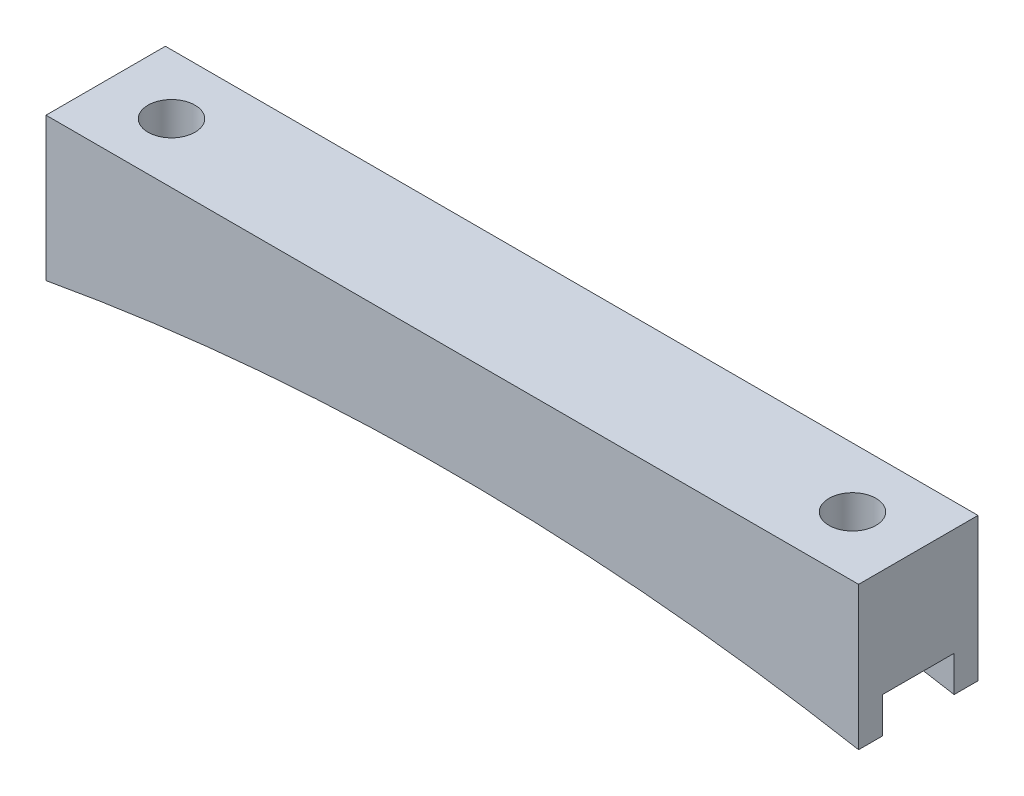
ISO-10303-21;
HEADER;
FILE_DESCRIPTION(('STEP AP214'),'2;1');
FILE_NAME('part.step','',(''),(''),'','','');
FILE_SCHEMA(('AUTOMOTIVE_DESIGN { 1 0 10303 214 1 1 1 1 }'));
ENDSEC;
DATA;
#1=APPLICATION_CONTEXT('core data for automotive mechanical design processes');
#2=APPLICATION_PROTOCOL_DEFINITION('international standard','automotive_design',2000,#1);
#3=PRODUCT_CONTEXT('',#1,'mechanical');
#4=PRODUCT('Part','Part','',(#3));
#5=PRODUCT_RELATED_PRODUCT_CATEGORY('part','',(#4));
#6=PRODUCT_DEFINITION_FORMATION('','',#4);
#7=PRODUCT_DEFINITION_CONTEXT('part definition',#1,'design');
#8=PRODUCT_DEFINITION('design','',#6,#7);
#9=PRODUCT_DEFINITION_SHAPE('','',#8);
#10=(LENGTH_UNIT() NAMED_UNIT(*) SI_UNIT(.MILLI.,.METRE.));
#11=(NAMED_UNIT(*) PLANE_ANGLE_UNIT() SI_UNIT($,.RADIAN.));
#12=(NAMED_UNIT(*) SI_UNIT($,.STERADIAN.) SOLID_ANGLE_UNIT());
#13=UNCERTAINTY_MEASURE_WITH_UNIT(LENGTH_MEASURE(1.E-05),#10,'distance_accuracy_value','');
#14=(GEOMETRIC_REPRESENTATION_CONTEXT(3) GLOBAL_UNCERTAINTY_ASSIGNED_CONTEXT((#13)) GLOBAL_UNIT_ASSIGNED_CONTEXT((#10,
#11,#12)) REPRESENTATION_CONTEXT('',''));
#15=CARTESIAN_POINT('',(0.,0.,0.));
#16=DIRECTION('',(0.,0.,1.));
#17=DIRECTION('',(1.,0.,0.));
#18=AXIS2_PLACEMENT_3D('',#15,#16,#17);
#19=CARTESIAN_POINT('',(43.22,0.,12.7));
#20=DIRECTION('',(-1.,0.,0.));
#21=DIRECTION('',(0.,-1.,0.));
#22=AXIS2_PLACEMENT_3D('',#19,#20,#21);
#23=PLANE('',#22);
#24=DIRECTION('',(0.,0.,-1.));
#25=VECTOR('',#24,1.);
#26=CARTESIAN_POINT('',(43.22,-15.24,12.7));
#27=LINE('',#26,#25);
#28=CARTESIAN_POINT('',(43.22,-15.24,12.7));
#29=VERTEX_POINT('',#28);
#30=CARTESIAN_POINT('',(43.22,-15.24,10.16));
#31=VERTEX_POINT('',#30);
#32=EDGE_CURVE('E156',#29,#31,#27,.T.);
#33=ORIENTED_EDGE('',*,*,#32,.T.);
#34=DIRECTION('',(0.,-1.,0.));
#35=VECTOR('',#34,1.);
#36=CARTESIAN_POINT('',(43.22,-15.24,10.16));
#37=LINE('',#36,#35);
#38=CARTESIAN_POINT('',(43.22,-11.43,10.16));
#39=VERTEX_POINT('',#38);
#40=EDGE_CURVE('E185',#39,#31,#37,.T.);
#41=ORIENTED_EDGE('',*,*,#40,.F.);
#42=DIRECTION('',(0.,0.,1.));
#43=VECTOR('',#42,1.);
#44=CARTESIAN_POINT('',(43.22,-11.43,10.16));
#45=LINE('',#44,#43);
#46=CARTESIAN_POINT('',(43.22,-11.43,2.54));
#47=VERTEX_POINT('',#46);
#48=EDGE_CURVE('E141',#47,#39,#45,.T.);
#49=ORIENTED_EDGE('',*,*,#48,.F.);
#50=DIRECTION('',(0.,1.,0.));
#51=VECTOR('',#50,1.);
#52=CARTESIAN_POINT('',(43.22,-15.24,2.54));
#53=LINE('',#52,#51);
#54=CARTESIAN_POINT('',(43.22,-15.24,2.54));
#55=VERTEX_POINT('',#54);
#56=EDGE_CURVE('E177',#55,#47,#53,.T.);
#57=ORIENTED_EDGE('',*,*,#56,.F.);
#58=CARTESIAN_POINT('',(43.22,-15.24,0.));
#59=VERTEX_POINT('',#58);
#60=EDGE_CURVE('E174',#55,#59,#27,.T.);
#61=ORIENTED_EDGE('',*,*,#60,.T.);
#62=DIRECTION('',(0.,1.,0.));
#63=VECTOR('',#62,1.);
#64=CARTESIAN_POINT('',(43.22,0.,0.));
#65=LINE('',#64,#63);
#66=CARTESIAN_POINT('',(43.22,0.,0.));
#67=VERTEX_POINT('',#66);
#68=EDGE_CURVE('E213',#59,#67,#65,.T.);
#69=ORIENTED_EDGE('',*,*,#68,.T.);
#70=DIRECTION('',(0.,0.,-1.));
#71=VECTOR('',#70,1.);
#72=CARTESIAN_POINT('',(43.22,0.,12.7));
#73=LINE('',#72,#71);
#74=CARTESIAN_POINT('',(43.22,0.,12.7));
#75=VERTEX_POINT('',#74);
#76=EDGE_CURVE('E154',#75,#67,#73,.T.);
#77=ORIENTED_EDGE('',*,*,#76,.F.);
#78=DIRECTION('',(0.,1.,0.));
#79=VECTOR('',#78,1.);
#80=CARTESIAN_POINT('',(43.22,0.,12.7));
#81=LINE('',#80,#79);
#82=EDGE_CURVE('E217',#29,#75,#81,.T.);
#83=ORIENTED_EDGE('',*,*,#82,.F.);
#84=EDGE_LOOP('',(#33,#41,#49,#57,#61,#69,#77,#83));
#85=FACE_BOUND('',#84,.T.);
#86=ADVANCED_FACE('F43',(#85),#23,.F.);
#87=CARTESIAN_POINT('',(-43.22,0.,12.7));
#88=DIRECTION('',(0.,-1.,0.));
#89=DIRECTION('',(1.,0.,0.));
#90=AXIS2_PLACEMENT_3D('',#87,#88,#89);
#91=PLANE('',#90);
#92=CARTESIAN_POINT('',(-36.22,0.,6.35));
#93=DIRECTION('',(0.,1.,0.));
#94=DIRECTION('',(-1.,0.,0.));
#95=AXIS2_PLACEMENT_3D('',#92,#93,#94);
#96=CIRCLE('',#95,2.49999999999999);
#97=CARTESIAN_POINT('',(-38.72,0.,6.35));
#98=VERTEX_POINT('',#97);
#99=EDGE_CURVE('E209',#98,#98,#96,.T.);
#100=ORIENTED_EDGE('',*,*,#99,.F.);
#101=EDGE_LOOP('',(#100));
#102=FACE_BOUND('',#101,.T.);
#103=CARTESIAN_POINT('',(36.22,0.,6.35));
#104=DIRECTION('',(0.,1.,0.));
#105=DIRECTION('',(-1.,0.,0.));
#106=AXIS2_PLACEMENT_3D('',#103,#104,#105);
#107=CIRCLE('',#106,2.5);
#108=CARTESIAN_POINT('',(33.72,0.,6.35));
#109=VERTEX_POINT('',#108);
#110=EDGE_CURVE('E208',#109,#109,#107,.T.);
#111=ORIENTED_EDGE('',*,*,#110,.F.);
#112=EDGE_LOOP('',(#111));
#113=FACE_BOUND('',#112,.T.);
#114=DIRECTION('',(-1.,0.,0.));
#115=VECTOR('',#114,1.);
#116=CARTESIAN_POINT('',(-43.22,0.,0.));
#117=LINE('',#116,#115);
#118=CARTESIAN_POINT('',(-43.22,0.,0.));
#119=VERTEX_POINT('',#118);
#120=EDGE_CURVE('E232',#67,#119,#117,.T.);
#121=ORIENTED_EDGE('',*,*,#120,.T.);
#122=DIRECTION('',(0.,0.,-1.));
#123=VECTOR('',#122,1.);
#124=CARTESIAN_POINT('',(-43.22,0.,12.7));
#125=LINE('',#124,#123);
#126=CARTESIAN_POINT('',(-43.22,0.,12.7));
#127=VERTEX_POINT('',#126);
#128=EDGE_CURVE('E148',#127,#119,#125,.T.);
#129=ORIENTED_EDGE('',*,*,#128,.F.);
#130=DIRECTION('',(-1.,0.,0.));
#131=VECTOR('',#130,1.);
#132=CARTESIAN_POINT('',(-43.22,0.,12.7));
#133=LINE('',#132,#131);
#134=EDGE_CURVE('E221',#75,#127,#133,.T.);
#135=ORIENTED_EDGE('',*,*,#134,.F.);
#136=ORIENTED_EDGE('',*,*,#76,.T.);
#137=EDGE_LOOP('',(#121,#129,#135,#136));
#138=FACE_BOUND('',#137,.T.);
#139=ADVANCED_FACE('F247',(#102,#113,#138),#91,.F.);
#140=CARTESIAN_POINT('',(-43.22,0.,12.7));
#141=DIRECTION('',(1.,0.,0.));
#142=DIRECTION('',(0.,1.,0.));
#143=AXIS2_PLACEMENT_3D('',#140,#141,#142);
#144=PLANE('',#143);
#145=DIRECTION('',(0.,0.,1.));
#146=VECTOR('',#145,1.);
#147=CARTESIAN_POINT('',(-43.22,-11.43,10.16));
#148=LINE('',#147,#146);
#149=CARTESIAN_POINT('',(-43.22,-11.43,2.54));
#150=VERTEX_POINT('',#149);
#151=CARTESIAN_POINT('',(-43.22,-11.43,10.16));
#152=VERTEX_POINT('',#151);
#153=EDGE_CURVE('E139',#150,#152,#148,.T.);
#154=ORIENTED_EDGE('',*,*,#153,.T.);
#155=DIRECTION('',(0.,-1.,0.));
#156=VECTOR('',#155,1.);
#157=CARTESIAN_POINT('',(-43.22,-15.24,10.16));
#158=LINE('',#157,#156);
#159=CARTESIAN_POINT('',(-43.22,-15.24,10.16));
#160=VERTEX_POINT('',#159);
#161=EDGE_CURVE('E124',#152,#160,#158,.T.);
#162=ORIENTED_EDGE('',*,*,#161,.T.);
#163=DIRECTION('',(0.,0.,-1.));
#164=VECTOR('',#163,1.);
#165=CARTESIAN_POINT('',(-43.22,-15.24,12.7));
#166=LINE('',#165,#164);
#167=CARTESIAN_POINT('',(-43.22,-15.24,12.7));
#168=VERTEX_POINT('',#167);
#169=EDGE_CURVE('E136',#168,#160,#166,.T.);
#170=ORIENTED_EDGE('',*,*,#169,.F.);
#171=DIRECTION('',(0.,-1.,0.));
#172=VECTOR('',#171,1.);
#173=CARTESIAN_POINT('',(-43.22,0.,12.7));
#174=LINE('',#173,#172);
#175=EDGE_CURVE('E225',#127,#168,#174,.T.);
#176=ORIENTED_EDGE('',*,*,#175,.F.);
#177=ORIENTED_EDGE('',*,*,#128,.T.);
#178=DIRECTION('',(0.,-1.,0.));
#179=VECTOR('',#178,1.);
#180=CARTESIAN_POINT('',(-43.22,0.,0.));
#181=LINE('',#180,#179);
#182=CARTESIAN_POINT('',(-43.22,-15.24,0.));
#183=VERTEX_POINT('',#182);
#184=EDGE_CURVE('E235',#119,#183,#181,.T.);
#185=ORIENTED_EDGE('',*,*,#184,.T.);
#186=CARTESIAN_POINT('',(-43.22,-15.24,2.54));
#187=VERTEX_POINT('',#186);
#188=EDGE_CURVE('E149',#187,#183,#166,.T.);
#189=ORIENTED_EDGE('',*,*,#188,.F.);
#190=DIRECTION('',(0.,1.,0.));
#191=VECTOR('',#190,1.);
#192=CARTESIAN_POINT('',(-43.22,-15.24,2.54));
#193=LINE('',#192,#191);
#194=EDGE_CURVE('E67',#187,#150,#193,.T.);
#195=ORIENTED_EDGE('',*,*,#194,.T.);
#196=EDGE_LOOP('',(#154,#162,#170,#176,#177,#185,#189,#195));
#197=FACE_BOUND('',#196,.T.);
#198=ADVANCED_FACE('F134',(#197),#144,.F.);
#199=CARTESIAN_POINT('',(0.,-252.63781296381,12.7));
#200=DIRECTION('',(0.,0.,-1.));
#201=DIRECTION('',(-1.,0.,0.));
#202=AXIS2_PLACEMENT_3D('',#199,#200,#201);
#203=CYLINDRICAL_SURFACE('',#202,241.3);
#204=DIRECTION('',(0.,0.,-1.));
#205=VECTOR('',#204,1.);
#206=CARTESIAN_POINT('',(6.66940516206415,-11.43,12.7));
#207=LINE('',#206,#205);
#208=CARTESIAN_POINT('',(6.66940516206415,-11.43,2.54));
#209=VERTEX_POINT('',#208);
#210=CARTESIAN_POINT('',(6.66940516206415,-11.43,10.16));
#211=VERTEX_POINT('',#210);
#212=EDGE_CURVE('E172',#209,#211,#207,.F.);
#213=ORIENTED_EDGE('',*,*,#212,.T.);
#214=CARTESIAN_POINT('',(0.,-252.63781296381,10.16));
#215=DIRECTION('',(0.,0.,1.));
#216=DIRECTION('',(1.,0.,0.));
#217=AXIS2_PLACEMENT_3D('',#214,#215,#216);
#218=CIRCLE('',#217,241.3);
#219=EDGE_CURVE('E11',#211,#31,#218,.F.);
#220=ORIENTED_EDGE('',*,*,#219,.T.);
#221=ORIENTED_EDGE('',*,*,#32,.F.);
#222=CARTESIAN_POINT('',(0.,-252.63781296381,12.7));
#223=DIRECTION('',(0.,0.,-1.));
#224=DIRECTION('',(-1.,0.,0.));
#225=AXIS2_PLACEMENT_3D('',#222,#223,#224);
#226=CIRCLE('',#225,241.3);
#227=EDGE_CURVE('E146',#168,#29,#226,.T.);
#228=ORIENTED_EDGE('',*,*,#227,.F.);
#229=ORIENTED_EDGE('',*,*,#169,.T.);
#230=CARTESIAN_POINT('',(-6.66940516206415,-11.43,10.16));
#231=VERTEX_POINT('',#230);
#232=EDGE_CURVE('E46',#160,#231,#218,.F.);
#233=ORIENTED_EDGE('',*,*,#232,.T.);
#234=DIRECTION('',(0.,0.,-1.));
#235=VECTOR('',#234,1.);
#236=CARTESIAN_POINT('',(-6.66940516206415,-11.43,12.7));
#237=LINE('',#236,#235);
#238=CARTESIAN_POINT('',(-6.66940516206415,-11.43,2.54));
#239=VERTEX_POINT('',#238);
#240=EDGE_CURVE('E203',#231,#239,#237,.T.);
#241=ORIENTED_EDGE('',*,*,#240,.T.);
#242=CARTESIAN_POINT('',(0.,-252.63781296381,2.54));
#243=DIRECTION('',(0.,0.,-1.));
#244=DIRECTION('',(-1.,0.,0.));
#245=AXIS2_PLACEMENT_3D('',#242,#243,#244);
#246=CIRCLE('',#245,241.3);
#247=EDGE_CURVE('E131',#239,#187,#246,.F.);
#248=ORIENTED_EDGE('',*,*,#247,.T.);
#249=ORIENTED_EDGE('',*,*,#188,.T.);
#250=CARTESIAN_POINT('',(0.,-252.63781296381,0.));
#251=DIRECTION('',(0.,0.,-1.));
#252=DIRECTION('',(-1.,0.,0.));
#253=AXIS2_PLACEMENT_3D('',#250,#251,#252);
#254=CIRCLE('',#253,241.3);
#255=EDGE_CURVE('E222',#183,#59,#254,.T.);
#256=ORIENTED_EDGE('',*,*,#255,.T.);
#257=ORIENTED_EDGE('',*,*,#60,.F.);
#258=EDGE_CURVE('E52',#55,#209,#246,.F.);
#259=ORIENTED_EDGE('',*,*,#258,.T.);
#260=EDGE_LOOP('',(#213,#220,#221,#228,#229,#233,#241,#248,#249,#256,#257,#259));
#261=FACE_BOUND('',#260,.T.);
#262=ADVANCED_FACE('F144',(#261),#203,.F.);
#263=CARTESIAN_POINT('',(0.,-252.63781296381,12.7));
#264=DIRECTION('',(0.,0.,-1.));
#265=DIRECTION('',(-1.,0.,0.));
#266=AXIS2_PLACEMENT_3D('',#263,#264,#265);
#267=PLANE('',#266);
#268=ORIENTED_EDGE('',*,*,#82,.T.);
#269=ORIENTED_EDGE('',*,*,#134,.T.);
#270=ORIENTED_EDGE('',*,*,#175,.T.);
#271=ORIENTED_EDGE('',*,*,#227,.T.);
#272=EDGE_LOOP('',(#268,#269,#270,#271));
#273=FACE_BOUND('',#272,.T.);
#274=ADVANCED_FACE('F250',(#273),#267,.F.);
#275=CARTESIAN_POINT('',(0.,-252.63781296381,0.));
#276=DIRECTION('',(0.,0.,-1.));
#277=DIRECTION('',(-1.,0.,0.));
#278=AXIS2_PLACEMENT_3D('',#275,#276,#277);
#279=PLANE('',#278);
#280=ORIENTED_EDGE('',*,*,#68,.F.);
#281=ORIENTED_EDGE('',*,*,#255,.F.);
#282=ORIENTED_EDGE('',*,*,#184,.F.);
#283=ORIENTED_EDGE('',*,*,#120,.F.);
#284=EDGE_LOOP('',(#280,#281,#282,#283));
#285=FACE_BOUND('',#284,.T.);
#286=ADVANCED_FACE('F243',(#285),#279,.T.);
#287=CARTESIAN_POINT('',(36.22,-15.24,6.35));
#288=DIRECTION('',(0.,1.,0.));
#289=DIRECTION('',(-1.,0.,0.));
#290=AXIS2_PLACEMENT_3D('',#287,#288,#289);
#291=CYLINDRICAL_SURFACE('',#290,2.5);
#292=CARTESIAN_POINT('',(36.22,-11.43,6.35));
#293=DIRECTION('',(0.,1.,0.));
#294=DIRECTION('',(0.,0.,1.));
#295=AXIS2_PLACEMENT_3D('',#292,#293,#294);
#296=CIRCLE('',#295,2.5);
#297=CARTESIAN_POINT('',(36.22,-11.43,8.85));
#298=VERTEX_POINT('',#297);
#299=EDGE_CURVE('E166',#298,#298,#296,.F.);
#300=ORIENTED_EDGE('',*,*,#299,.T.);
#301=EDGE_LOOP('',(#300));
#302=FACE_BOUND('',#301,.T.);
#303=ORIENTED_EDGE('',*,*,#110,.T.);
#304=EDGE_LOOP('',(#303));
#305=FACE_BOUND('',#304,.T.);
#306=ADVANCED_FACE('F292',(#302,#305),#291,.F.);
#307=CARTESIAN_POINT('',(-36.22,-15.24,6.35));
#308=DIRECTION('',(0.,1.,0.));
#309=DIRECTION('',(-1.,0.,0.));
#310=AXIS2_PLACEMENT_3D('',#307,#308,#309);
#311=CYLINDRICAL_SURFACE('',#310,2.49999999999999);
#312=CARTESIAN_POINT('',(-36.22,-11.43,6.35));
#313=DIRECTION('',(0.,1.,0.));
#314=DIRECTION('',(0.,0.,1.));
#315=AXIS2_PLACEMENT_3D('',#312,#313,#314);
#316=CIRCLE('',#315,2.49999999999999);
#317=CARTESIAN_POINT('',(-36.22,-11.43,8.84999999999999));
#318=VERTEX_POINT('',#317);
#319=EDGE_CURVE('E163',#318,#318,#316,.F.);
#320=ORIENTED_EDGE('',*,*,#319,.T.);
#321=EDGE_LOOP('',(#320));
#322=FACE_BOUND('',#321,.T.);
#323=ORIENTED_EDGE('',*,*,#99,.T.);
#324=EDGE_LOOP('',(#323));
#325=FACE_BOUND('',#324,.T.);
#326=ADVANCED_FACE('F274',(#322,#325),#311,.F.);
#327=CARTESIAN_POINT('',(-43.22,-11.43,10.16));
#328=DIRECTION('',(0.,1.,0.));
#329=DIRECTION('',(0.,0.,1.));
#330=AXIS2_PLACEMENT_3D('',#327,#328,#329);
#331=PLANE('',#330);
#332=ORIENTED_EDGE('',*,*,#319,.F.);
#333=EDGE_LOOP('',(#332));
#334=FACE_BOUND('',#333,.T.);
#335=DIRECTION('',(1.,0.,0.));
#336=VECTOR('',#335,1.);
#337=CARTESIAN_POINT('',(-43.22,-11.43,10.16));
#338=LINE('',#337,#336);
#339=EDGE_CURVE('E126',#152,#231,#338,.T.);
#340=ORIENTED_EDGE('',*,*,#339,.F.);
#341=ORIENTED_EDGE('',*,*,#153,.F.);
#342=DIRECTION('',(1.,0.,0.));
#343=VECTOR('',#342,1.);
#344=CARTESIAN_POINT('',(-43.22,-11.43,2.54));
#345=LINE('',#344,#343);
#346=EDGE_CURVE('E196',#150,#239,#345,.T.);
#347=ORIENTED_EDGE('',*,*,#346,.T.);
#348=ORIENTED_EDGE('',*,*,#240,.F.);
#349=EDGE_LOOP('',(#340,#341,#347,#348));
#350=FACE_BOUND('',#349,.T.);
#351=ADVANCED_FACE('F266',(#334,#350),#331,.F.);
#352=CARTESIAN_POINT('',(-43.22,-15.24,2.54));
#353=DIRECTION('',(0.,0.,-1.));
#354=DIRECTION('',(-1.,0.,0.));
#355=AXIS2_PLACEMENT_3D('',#352,#353,#354);
#356=PLANE('',#355);
#357=ORIENTED_EDGE('',*,*,#346,.F.);
#358=ORIENTED_EDGE('',*,*,#194,.F.);
#359=ORIENTED_EDGE('',*,*,#247,.F.);
#360=EDGE_LOOP('',(#357,#358,#359));
#361=FACE_BOUND('',#360,.T.);
#362=ADVANCED_FACE('F271',(#361),#356,.F.);
#363=CARTESIAN_POINT('',(-43.22,-15.24,10.16));
#364=DIRECTION('',(0.,0.,1.));
#365=DIRECTION('',(1.,0.,0.));
#366=AXIS2_PLACEMENT_3D('',#363,#364,#365);
#367=PLANE('',#366);
#368=ORIENTED_EDGE('',*,*,#161,.F.);
#369=ORIENTED_EDGE('',*,*,#339,.T.);
#370=ORIENTED_EDGE('',*,*,#232,.F.);
#371=EDGE_LOOP('',(#368,#369,#370));
#372=FACE_BOUND('',#371,.T.);
#373=ADVANCED_FACE('F123',(#372),#367,.F.);
#374=EDGE_CURVE('E195',#211,#39,#338,.T.);
#375=ORIENTED_EDGE('',*,*,#374,.T.);
#376=ORIENTED_EDGE('',*,*,#40,.T.);
#377=ORIENTED_EDGE('',*,*,#219,.F.);
#378=EDGE_LOOP('',(#375,#376,#377));
#379=FACE_BOUND('',#378,.T.);
#380=ADVANCED_FACE('F254',(#379),#367,.F.);
#381=ORIENTED_EDGE('',*,*,#56,.T.);
#382=EDGE_CURVE('E59',#209,#47,#345,.T.);
#383=ORIENTED_EDGE('',*,*,#382,.F.);
#384=ORIENTED_EDGE('',*,*,#258,.F.);
#385=EDGE_LOOP('',(#381,#383,#384));
#386=FACE_BOUND('',#385,.T.);
#387=ADVANCED_FACE('F176',(#386),#356,.F.);
#388=ORIENTED_EDGE('',*,*,#299,.F.);
#389=EDGE_LOOP('',(#388));
#390=FACE_BOUND('',#389,.T.);
#391=ORIENTED_EDGE('',*,*,#382,.T.);
#392=ORIENTED_EDGE('',*,*,#48,.T.);
#393=ORIENTED_EDGE('',*,*,#374,.F.);
#394=ORIENTED_EDGE('',*,*,#212,.F.);
#395=EDGE_LOOP('',(#391,#392,#393,#394));
#396=FACE_BOUND('',#395,.T.);
#397=ADVANCED_FACE('F258',(#390,#396),#331,.F.);
#398=CLOSED_SHELL('',(#86,#139,#198,#262,#274,#286,#306,#326,#351,#362,#373,#380,#387,#397));
#399=MANIFOLD_SOLID_BREP('B2',#398);
#400=ADVANCED_BREP_SHAPE_REPRESENTATION('',(#18,#399),#14);
#401=SHAPE_DEFINITION_REPRESENTATION(#9,#400);
ENDSEC;
END-ISO-10303-21;
